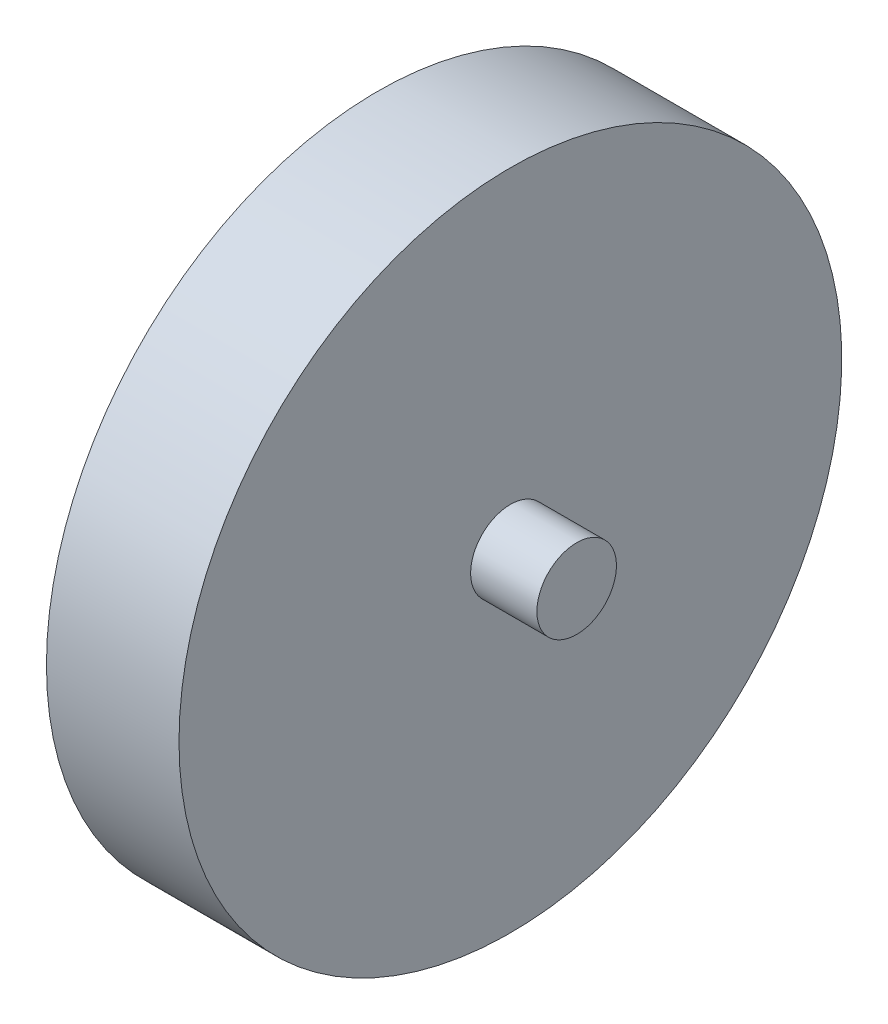
ISO-10303-21;
HEADER;
FILE_DESCRIPTION(('STEP AP214'),'2;1');
FILE_NAME('part.step','',(''),(''),'','','');
FILE_SCHEMA(('AUTOMOTIVE_DESIGN { 1 0 10303 214 1 1 1 1 }'));
ENDSEC;
DATA;
#1=APPLICATION_CONTEXT('core data for automotive mechanical design processes');
#2=APPLICATION_PROTOCOL_DEFINITION('international standard','automotive_design',2000,#1);
#3=PRODUCT_CONTEXT('',#1,'mechanical');
#4=PRODUCT('Part','Part','',(#3));
#5=PRODUCT_RELATED_PRODUCT_CATEGORY('part','',(#4));
#6=PRODUCT_DEFINITION_FORMATION('','',#4);
#7=PRODUCT_DEFINITION_CONTEXT('part definition',#1,'design');
#8=PRODUCT_DEFINITION('design','',#6,#7);
#9=PRODUCT_DEFINITION_SHAPE('','',#8);
#10=(LENGTH_UNIT() NAMED_UNIT(*) SI_UNIT(.MILLI.,.METRE.));
#11=(NAMED_UNIT(*) PLANE_ANGLE_UNIT() SI_UNIT($,.RADIAN.));
#12=(NAMED_UNIT(*) SI_UNIT($,.STERADIAN.) SOLID_ANGLE_UNIT());
#13=UNCERTAINTY_MEASURE_WITH_UNIT(LENGTH_MEASURE(1.E-05),#10,'distance_accuracy_value','');
#14=(GEOMETRIC_REPRESENTATION_CONTEXT(3) GLOBAL_UNCERTAINTY_ASSIGNED_CONTEXT((#13)) GLOBAL_UNIT_ASSIGNED_CONTEXT((#10,
#11,#12)) REPRESENTATION_CONTEXT('',''));
#15=CARTESIAN_POINT('',(0.,0.,0.));
#16=DIRECTION('',(0.,0.,1.));
#17=DIRECTION('',(1.,0.,0.));
#18=AXIS2_PLACEMENT_3D('',#15,#16,#17);
#19=CARTESIAN_POINT('',(0.,0.,0.));
#20=DIRECTION('',(1.,0.,0.));
#21=DIRECTION('',(0.,0.,-1.));
#22=AXIS2_PLACEMENT_3D('',#19,#20,#21);
#23=PLANE('',#22);
#24=CARTESIAN_POINT('',(0.,0.,0.));
#25=DIRECTION('',(-1.,0.,0.));
#26=DIRECTION('',(0.,0.,1.));
#27=AXIS2_PLACEMENT_3D('',#24,#25,#26);
#28=CIRCLE('',#27,50.);
#29=CARTESIAN_POINT('',(0.,0.,50.));
#30=VERTEX_POINT('',#29);
#31=EDGE_CURVE('E10',#30,#30,#28,.T.);
#32=ORIENTED_EDGE('',*,*,#31,.T.);
#33=EDGE_LOOP('',(#32));
#34=FACE_BOUND('',#33,.T.);
#35=ADVANCED_FACE('F31',(#34),#23,.F.);
#36=CARTESIAN_POINT('',(0.,0.,0.));
#37=DIRECTION('',(-1.,0.,0.));
#38=DIRECTION('',(0.,0.,1.));
#39=AXIS2_PLACEMENT_3D('',#36,#37,#38);
#40=CYLINDRICAL_SURFACE('',#39,50.);
#41=ORIENTED_EDGE('',*,*,#31,.F.);
#42=EDGE_LOOP('',(#41));
#43=FACE_BOUND('',#42,.T.);
#44=CARTESIAN_POINT('',(20.,0.,0.));
#45=DIRECTION('',(-1.,0.,0.));
#46=DIRECTION('',(0.,0.,1.));
#47=AXIS2_PLACEMENT_3D('',#44,#45,#46);
#48=CIRCLE('',#47,50.);
#49=CARTESIAN_POINT('',(20.,0.,50.));
#50=VERTEX_POINT('',#49);
#51=EDGE_CURVE('E37',#50,#50,#48,.T.);
#52=ORIENTED_EDGE('',*,*,#51,.T.);
#53=EDGE_LOOP('',(#52));
#54=FACE_BOUND('',#53,.T.);
#55=ADVANCED_FACE('F63',(#43,#54),#40,.T.);
#56=CARTESIAN_POINT('',(20.,50.,0.));
#57=DIRECTION('',(-1.,0.,0.));
#58=DIRECTION('',(0.,0.,1.));
#59=AXIS2_PLACEMENT_3D('',#56,#57,#58);
#60=PLANE('',#59);
#61=ORIENTED_EDGE('',*,*,#51,.F.);
#62=EDGE_LOOP('',(#61));
#63=FACE_BOUND('',#62,.T.);
#64=CARTESIAN_POINT('',(20.,0.,0.));
#65=DIRECTION('',(-1.,0.,0.));
#66=DIRECTION('',(0.,0.,1.));
#67=AXIS2_PLACEMENT_3D('',#64,#65,#66);
#68=CIRCLE('',#67,6.);
#69=CARTESIAN_POINT('',(20.,0.,6.));
#70=VERTEX_POINT('',#69);
#71=EDGE_CURVE('E41',#70,#70,#68,.T.);
#72=ORIENTED_EDGE('',*,*,#71,.T.);
#73=EDGE_LOOP('',(#72));
#74=FACE_BOUND('',#73,.T.);
#75=ADVANCED_FACE('F59',(#63,#74),#60,.F.);
#76=CARTESIAN_POINT('',(0.,0.,0.));
#77=DIRECTION('',(-1.,0.,0.));
#78=DIRECTION('',(0.,0.,1.));
#79=AXIS2_PLACEMENT_3D('',#76,#77,#78);
#80=CYLINDRICAL_SURFACE('',#79,6.);
#81=ORIENTED_EDGE('',*,*,#71,.F.);
#82=EDGE_LOOP('',(#81));
#83=FACE_BOUND('',#82,.T.);
#84=CARTESIAN_POINT('',(30.,0.,0.));
#85=DIRECTION('',(-1.,0.,0.));
#86=DIRECTION('',(0.,0.,1.));
#87=AXIS2_PLACEMENT_3D('',#84,#85,#86);
#88=CIRCLE('',#87,6.);
#89=CARTESIAN_POINT('',(30.,0.,6.));
#90=VERTEX_POINT('',#89);
#91=EDGE_CURVE('E45',#90,#90,#88,.T.);
#92=ORIENTED_EDGE('',*,*,#91,.T.);
#93=EDGE_LOOP('',(#92));
#94=FACE_BOUND('',#93,.T.);
#95=ADVANCED_FACE('F51',(#83,#94),#80,.T.);
#96=CARTESIAN_POINT('',(30.,6.,0.));
#97=DIRECTION('',(-1.,0.,0.));
#98=DIRECTION('',(0.,0.,1.));
#99=AXIS2_PLACEMENT_3D('',#96,#97,#98);
#100=PLANE('',#99);
#101=ORIENTED_EDGE('',*,*,#91,.F.);
#102=EDGE_LOOP('',(#101));
#103=FACE_BOUND('',#102,.T.);
#104=ADVANCED_FACE('F53',(#103),#100,.F.);
#105=CLOSED_SHELL('',(#35,#55,#75,#95,#104));
#106=MANIFOLD_SOLID_BREP('B2',#105);
#107=ADVANCED_BREP_SHAPE_REPRESENTATION('',(#18,#106),#14);
#108=SHAPE_DEFINITION_REPRESENTATION(#9,#107);
ENDSEC;
END-ISO-10303-21;
